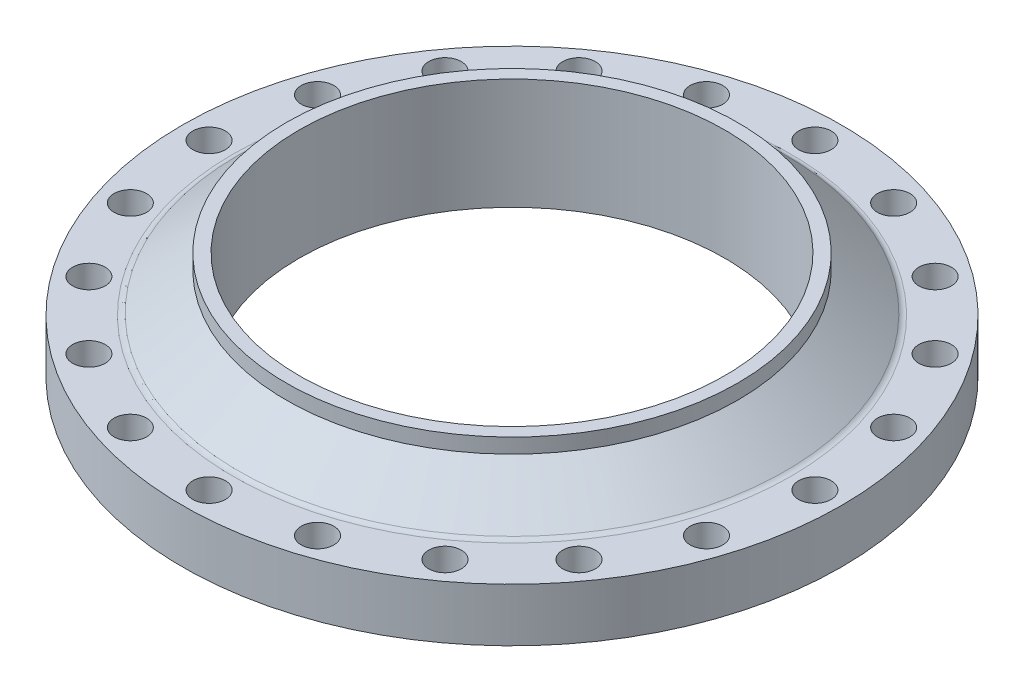
ISO-10303-21;
HEADER;
FILE_DESCRIPTION(('STEP AP214'),'2;1');
FILE_NAME('part.step','',(''),(''),'','','');
FILE_SCHEMA(('AUTOMOTIVE_DESIGN { 1 0 10303 214 1 1 1 1 }'));
ENDSEC;
DATA;
#1=APPLICATION_CONTEXT('core data for automotive mechanical design processes');
#2=APPLICATION_PROTOCOL_DEFINITION('international standard','automotive_design',2000,#1);
#3=PRODUCT_CONTEXT('',#1,'mechanical');
#4=PRODUCT('Part','Part','',(#3));
#5=PRODUCT_RELATED_PRODUCT_CATEGORY('part','',(#4));
#6=PRODUCT_DEFINITION_FORMATION('','',#4);
#7=PRODUCT_DEFINITION_CONTEXT('part definition',#1,'design');
#8=PRODUCT_DEFINITION('design','',#6,#7);
#9=PRODUCT_DEFINITION_SHAPE('','',#8);
#10=(LENGTH_UNIT() NAMED_UNIT(*) SI_UNIT(.MILLI.,.METRE.));
#11=(NAMED_UNIT(*) PLANE_ANGLE_UNIT() SI_UNIT($,.RADIAN.));
#12=(NAMED_UNIT(*) SI_UNIT($,.STERADIAN.) SOLID_ANGLE_UNIT());
#13=UNCERTAINTY_MEASURE_WITH_UNIT(LENGTH_MEASURE(1.E-05),#10,'distance_accuracy_value','');
#14=(GEOMETRIC_REPRESENTATION_CONTEXT(3) GLOBAL_UNCERTAINTY_ASSIGNED_CONTEXT((#13)) GLOBAL_UNIT_ASSIGNED_CONTEXT((#10,
#11,#12)) REPRESENTATION_CONTEXT('',''));
#15=CARTESIAN_POINT('',(0.,0.,0.));
#16=DIRECTION('',(0.,0.,1.));
#17=DIRECTION('',(1.,0.,0.));
#18=AXIS2_PLACEMENT_3D('',#15,#16,#17);
#19=CARTESIAN_POINT('',(0.,150.,0.));
#20=DIRECTION('',(0.,1.,0.));
#21=DIRECTION('',(-1.,0.,0.));
#22=AXIS2_PLACEMENT_3D('',#19,#20,#21);
#23=CYLINDRICAL_SURFACE('',#22,287.4);
#24=CARTESIAN_POINT('',(0.,0.,0.));
#25=DIRECTION('',(0.,1.,0.));
#26=DIRECTION('',(-1.,0.,0.));
#27=AXIS2_PLACEMENT_3D('',#24,#25,#26);
#28=CIRCLE('',#27,287.4);
#29=CARTESIAN_POINT('',(-287.4,0.,0.));
#30=VERTEX_POINT('',#29);
#31=EDGE_CURVE('E10',#30,#30,#28,.T.);
#32=ORIENTED_EDGE('',*,*,#31,.F.);
#33=EDGE_LOOP('',(#32));
#34=FACE_BOUND('',#33,.T.);
#35=CARTESIAN_POINT('',(0.,150.,0.));
#36=DIRECTION('',(0.,1.,0.));
#37=DIRECTION('',(-1.,0.,0.));
#38=AXIS2_PLACEMENT_3D('',#35,#36,#37);
#39=CIRCLE('',#38,287.4);
#40=CARTESIAN_POINT('',(-287.4,150.,0.));
#41=VERTEX_POINT('',#40);
#42=EDGE_CURVE('E80',#41,#41,#39,.T.);
#43=ORIENTED_EDGE('',*,*,#42,.T.);
#44=EDGE_LOOP('',(#43));
#45=FACE_BOUND('',#44,.T.);
#46=ADVANCED_FACE('F37',(#34,#45),#23,.F.);
#47=CARTESIAN_POINT('',(370.,0.,0.));
#48=DIRECTION('',(0.,1.,0.));
#49=DIRECTION('',(-1.,0.,0.));
#50=AXIS2_PLACEMENT_3D('',#47,#48,#49);
#51=PLANE('',#50);
#52=CARTESIAN_POINT('',(0.,0.,0.));
#53=DIRECTION('',(0.,1.,0.));
#54=DIRECTION('',(-1.,0.,0.));
#55=AXIS2_PLACEMENT_3D('',#52,#53,#54);
#56=CIRCLE('',#55,370.);
#57=CARTESIAN_POINT('',(-370.,0.,0.));
#58=VERTEX_POINT('',#57);
#59=EDGE_CURVE('E44',#58,#58,#56,.T.);
#60=ORIENTED_EDGE('',*,*,#59,.F.);
#61=EDGE_LOOP('',(#60));
#62=FACE_BOUND('',#61,.T.);
#63=ORIENTED_EDGE('',*,*,#31,.T.);
#64=EDGE_LOOP('',(#63));
#65=FACE_BOUND('',#64,.T.);
#66=ADVANCED_FACE('F266',(#62,#65),#51,.F.);
#67=CARTESIAN_POINT('',(0.,0.,0.));
#68=DIRECTION('',(0.,1.,0.));
#69=DIRECTION('',(-1.,0.,0.));
#70=AXIS2_PLACEMENT_3D('',#67,#68,#69);
#71=CONICAL_SURFACE('',#70,370.,0.785398163397448);
#72=CARTESIAN_POINT('',(0.,5.,0.));
#73=DIRECTION('',(0.,1.,0.));
#74=DIRECTION('',(-1.,0.,0.));
#75=AXIS2_PLACEMENT_3D('',#72,#73,#74);
#76=CIRCLE('',#75,375.);
#77=CARTESIAN_POINT('',(-375.,5.00000000000001,0.));
#78=VERTEX_POINT('',#77);
#79=EDGE_CURVE('E49',#78,#78,#76,.T.);
#80=ORIENTED_EDGE('',*,*,#79,.F.);
#81=EDGE_LOOP('',(#80));
#82=FACE_BOUND('',#81,.T.);
#83=ORIENTED_EDGE('',*,*,#59,.T.);
#84=EDGE_LOOP('',(#83));
#85=FACE_BOUND('',#84,.T.);
#86=ADVANCED_FACE('F252',(#82,#85),#71,.T.);
#87=CARTESIAN_POINT('',(445.,5.00000000000001,0.));
#88=DIRECTION('',(0.,1.,0.));
#89=DIRECTION('',(-1.,0.,0.));
#90=AXIS2_PLACEMENT_3D('',#87,#88,#89);
#91=PLANE('',#90);
#92=CARTESIAN_POINT('',(-388.98211516471,5.00000000000002,126.387950699342));
#93=DIRECTION('',(0.,-1.,0.));
#94=DIRECTION('',(1.,0.,0.));
#95=AXIS2_PLACEMENT_3D('',#92,#93,#94);
#96=CIRCLE('',#95,22.0000000000154);
#97=CARTESIAN_POINT('',(-366.982115164694,5.00000000000002,126.387950699342));
#98=VERTEX_POINT('',#97);
#99=EDGE_CURVE('E162',#98,#98,#96,.T.);
#100=ORIENTED_EDGE('',*,*,#99,.F.);
#101=EDGE_LOOP('',(#100));
#102=FACE_BOUND('',#101,.T.);
#103=CARTESIAN_POINT('',(-408.999999999988,5.00000000000003,-1.16244791570352E-11));
#104=DIRECTION('',(0.,-1.,0.));
#105=DIRECTION('',(1.,0.,0.));
#106=AXIS2_PLACEMENT_3D('',#103,#104,#105);
#107=CIRCLE('',#106,22.0000000000186);
#108=CARTESIAN_POINT('',(-386.99999999997,5.00000000000002,-1.16244791570352E-11));
#109=VERTEX_POINT('',#108);
#110=EDGE_CURVE('E161',#109,#109,#107,.T.);
#111=ORIENTED_EDGE('',*,*,#110,.F.);
#112=EDGE_LOOP('',(#111));
#113=FACE_BOUND('',#112,.T.);
#114=CARTESIAN_POINT('',(-388.982115164703,5.00000000000002,-126.387950699365));
#115=DIRECTION('',(0.,-1.,0.));
#116=DIRECTION('',(1.,0.,0.));
#117=AXIS2_PLACEMENT_3D('',#114,#115,#116);
#118=CIRCLE('',#117,22.0000000000215);
#119=CARTESIAN_POINT('',(-366.982115164681,5.00000000000002,-126.387950699365));
#120=VERTEX_POINT('',#119);
#121=EDGE_CURVE('E171',#120,#120,#118,.T.);
#122=ORIENTED_EDGE('',*,*,#121,.F.);
#123=EDGE_LOOP('',(#122));
#124=FACE_BOUND('',#123,.T.);
#125=CARTESIAN_POINT('',(-330.887950699335,5.00000000000002,-240.404168187631));
#126=DIRECTION('',(0.,-1.,0.));
#127=DIRECTION('',(1.,0.,0.));
#128=AXIS2_PLACEMENT_3D('',#125,#126,#127);
#129=CIRCLE('',#128,22.0000000000241);
#130=CARTESIAN_POINT('',(-308.887950699311,5.00000000000002,-240.404168187631));
#131=VERTEX_POINT('',#130);
#132=EDGE_CURVE('E179',#131,#131,#129,.T.);
#133=ORIENTED_EDGE('',*,*,#132,.F.);
#134=EDGE_LOOP('',(#133));
#135=FACE_BOUND('',#134,.T.);
#136=CARTESIAN_POINT('',(-240.404168187601,5.00000000000002,-330.88795069936));
#137=DIRECTION('',(0.,-1.,0.));
#138=DIRECTION('',(1.,0.,0.));
#139=AXIS2_PLACEMENT_3D('',#136,#137,#138);
#140=CIRCLE('',#139,22.0000000000254);
#141=CARTESIAN_POINT('',(-218.404168187575,5.00000000000002,-330.88795069936));
#142=VERTEX_POINT('',#141);
#143=EDGE_CURVE('E187',#142,#142,#140,.T.);
#144=ORIENTED_EDGE('',*,*,#143,.F.);
#145=EDGE_LOOP('',(#144));
#146=FACE_BOUND('',#145,.T.);
#147=CARTESIAN_POINT('',(-126.387950699331,5.00000000000002,-388.982115164721));
#148=DIRECTION('',(0.,-1.,0.));
#149=DIRECTION('',(1.,0.,0.));
#150=AXIS2_PLACEMENT_3D('',#147,#148,#149);
#151=CIRCLE('',#150,22.0000000000257);
#152=CARTESIAN_POINT('',(-104.387950699305,5.00000000000002,-388.982115164721));
#153=VERTEX_POINT('',#152);
#154=EDGE_CURVE('E195',#153,#153,#151,.T.);
#155=ORIENTED_EDGE('',*,*,#154,.F.);
#156=EDGE_LOOP('',(#155));
#157=FACE_BOUND('',#156,.T.);
#158=CARTESIAN_POINT('',(2.31488939371632E-11,5.00000000000002,-409.));
#159=DIRECTION('',(0.,-1.,0.));
#160=DIRECTION('',(1.,0.,0.));
#161=AXIS2_PLACEMENT_3D('',#158,#159,#160);
#162=CIRCLE('',#161,22.0000000000249);
#163=CARTESIAN_POINT('',(22.000000000048,5.00000000000002,-409.));
#164=VERTEX_POINT('',#163);
#165=EDGE_CURVE('E203',#164,#164,#162,.T.);
#166=ORIENTED_EDGE('',*,*,#165,.F.);
#167=EDGE_LOOP('',(#166));
#168=FACE_BOUND('',#167,.T.);
#169=CARTESIAN_POINT('',(126.387950699376,5.00000000000001,-388.982115164714));
#170=DIRECTION('',(0.,-1.,0.));
#171=DIRECTION('',(1.,0.,0.));
#172=AXIS2_PLACEMENT_3D('',#169,#170,#171);
#173=CIRCLE('',#172,22.0000000000231);
#174=CARTESIAN_POINT('',(148.387950699399,5.00000000000001,-388.982115164714));
#175=VERTEX_POINT('',#174);
#176=EDGE_CURVE('E211',#175,#175,#173,.T.);
#177=ORIENTED_EDGE('',*,*,#176,.F.);
#178=EDGE_LOOP('',(#177));
#179=FACE_BOUND('',#178,.T.);
#180=CARTESIAN_POINT('',(240.404168187642,5.00000000000001,-330.887950699347));
#181=DIRECTION('',(0.,-1.,0.));
#182=DIRECTION('',(1.,0.,0.));
#183=AXIS2_PLACEMENT_3D('',#180,#181,#182);
#184=CIRCLE('',#183,22.0000000000203);
#185=CARTESIAN_POINT('',(262.404168187663,5.00000000000001,-330.887950699347));
#186=VERTEX_POINT('',#185);
#187=EDGE_CURVE('E98',#186,#186,#184,.T.);
#188=ORIENTED_EDGE('',*,*,#187,.F.);
#189=EDGE_LOOP('',(#188));
#190=FACE_BOUND('',#189,.T.);
#191=CARTESIAN_POINT('',(330.887950699372,5.00000000000001,-240.404168187612));
#192=DIRECTION('',(0.,-1.,0.));
#193=DIRECTION('',(1.,0.,0.));
#194=AXIS2_PLACEMENT_3D('',#191,#192,#193);
#195=CIRCLE('',#194,22.0000000000167);
#196=CARTESIAN_POINT('',(352.887950699389,5.00000000000001,-240.404168187612));
#197=VERTEX_POINT('',#196);
#198=EDGE_CURVE('E97',#197,#197,#195,.T.);
#199=ORIENTED_EDGE('',*,*,#198,.F.);
#200=EDGE_LOOP('',(#199));
#201=FACE_BOUND('',#200,.T.);
#202=CARTESIAN_POINT('',(388.982115164733,5.00000000000001,-126.387950699342));
#203=DIRECTION('',(0.,-1.,0.));
#204=DIRECTION('',(1.,0.,0.));
#205=AXIS2_PLACEMENT_3D('',#202,#203,#204);
#206=CIRCLE('',#205,22.000000000013);
#207=CARTESIAN_POINT('',(410.982115164746,5.00000000000001,-126.387950699342));
#208=VERTEX_POINT('',#207);
#209=EDGE_CURVE('E107',#208,#208,#206,.T.);
#210=ORIENTED_EDGE('',*,*,#209,.F.);
#211=EDGE_LOOP('',(#210));
#212=FACE_BOUND('',#211,.T.);
#213=CARTESIAN_POINT('',(409.000000000012,5.00000000000001,1.15743911029501E-11));
#214=DIRECTION('',(0.,-1.,0.));
#215=DIRECTION('',(1.,0.,0.));
#216=AXIS2_PLACEMENT_3D('',#213,#214,#215);
#217=CIRCLE('',#216,22.0000000000091);
#218=CARTESIAN_POINT('',(431.000000000021,5.00000000000001,1.15743911029501E-11));
#219=VERTEX_POINT('',#218);
#220=EDGE_CURVE('E115',#219,#219,#217,.T.);
#221=ORIENTED_EDGE('',*,*,#220,.F.);
#222=EDGE_LOOP('',(#221));
#223=FACE_BOUND('',#222,.T.);
#224=CARTESIAN_POINT('',(388.982115164726,5.00000000000001,126.387950699365));
#225=DIRECTION('',(0.,-1.,0.));
#226=DIRECTION('',(1.,0.,0.));
#227=AXIS2_PLACEMENT_3D('',#224,#225,#226);
#228=CIRCLE('',#227,22.0000000000057);
#229=CARTESIAN_POINT('',(410.982115164732,5.00000000000001,126.387950699365));
#230=VERTEX_POINT('',#229);
#231=EDGE_CURVE('E123',#230,#230,#228,.T.);
#232=ORIENTED_EDGE('',*,*,#231,.F.);
#233=EDGE_LOOP('',(#232));
#234=FACE_BOUND('',#233,.T.);
#235=CARTESIAN_POINT('',(330.887950699358,5.00000000000001,240.404168187631));
#236=DIRECTION('',(0.,-1.,0.));
#237=DIRECTION('',(1.,0.,0.));
#238=AXIS2_PLACEMENT_3D('',#235,#236,#237);
#239=CIRCLE('',#238,22.0000000000027);
#240=CARTESIAN_POINT('',(352.887950699361,5.00000000000001,240.404168187631));
#241=VERTEX_POINT('',#240);
#242=EDGE_CURVE('E131',#241,#241,#239,.T.);
#243=ORIENTED_EDGE('',*,*,#242,.F.);
#244=EDGE_LOOP('',(#243));
#245=FACE_BOUND('',#244,.T.);
#246=CARTESIAN_POINT('',(240.404168187622,5.00000000000001,330.887950699353));
#247=DIRECTION('',(0.,-1.,0.));
#248=DIRECTION('',(1.,0.,0.));
#249=AXIS2_PLACEMENT_3D('',#246,#247,#248);
#250=CIRCLE('',#249,22.);
#251=CARTESIAN_POINT('',(262.404168187622,5.00000000000001,330.887950699353));
#252=VERTEX_POINT('',#251);
#253=EDGE_CURVE('E139',#252,#252,#250,.T.);
#254=ORIENTED_EDGE('',*,*,#253,.F.);
#255=EDGE_LOOP('',(#254));
#256=FACE_BOUND('',#255,.T.);
#257=CARTESIAN_POINT('',(126.387950699354,5.00000000000001,388.982115164718));
#258=DIRECTION('',(0.,-1.,0.));
#259=DIRECTION('',(1.,0.,0.));
#260=AXIS2_PLACEMENT_3D('',#257,#258,#259);
#261=CIRCLE('',#260,22.);
#262=CARTESIAN_POINT('',(148.387950699354,5.00000000000001,388.982115164718));
#263=VERTEX_POINT('',#262);
#264=EDGE_CURVE('E147',#263,#263,#261,.T.);
#265=ORIENTED_EDGE('',*,*,#264,.F.);
#266=EDGE_LOOP('',(#265));
#267=FACE_BOUND('',#266,.T.);
#268=CARTESIAN_POINT('',(-330.887950699349,5.00000000000002,240.404168187612));
#269=DIRECTION('',(0.,-1.,0.));
#270=DIRECTION('',(1.,0.,0.));
#271=AXIS2_PLACEMENT_3D('',#268,#269,#270);
#272=CIRCLE('',#271,22.0000000000122);
#273=CARTESIAN_POINT('',(-308.887950699336,5.00000000000002,240.404168187612));
#274=VERTEX_POINT('',#273);
#275=EDGE_CURVE('E234',#274,#274,#272,.T.);
#276=ORIENTED_EDGE('',*,*,#275,.F.);
#277=EDGE_LOOP('',(#276));
#278=FACE_BOUND('',#277,.T.);
#279=CARTESIAN_POINT('',(-240.404168187619,5.00000000000002,330.887950699347));
#280=DIRECTION('',(0.,-1.,0.));
#281=DIRECTION('',(1.,0.,0.));
#282=AXIS2_PLACEMENT_3D('',#279,#280,#281);
#283=CIRCLE('',#282,22.0000000000093);
#284=CARTESIAN_POINT('',(-218.40416818761,5.00000000000002,330.887950699347));
#285=VERTEX_POINT('',#284);
#286=EDGE_CURVE('E225',#285,#285,#283,.T.);
#287=ORIENTED_EDGE('',*,*,#286,.F.);
#288=EDGE_LOOP('',(#287));
#289=FACE_BOUND('',#288,.T.);
#290=CARTESIAN_POINT('',(-126.387950699348,5.00000000000002,388.982115164719));
#291=DIRECTION('',(0.,-1.,0.));
#292=DIRECTION('',(1.,0.,0.));
#293=AXIS2_PLACEMENT_3D('',#290,#291,#292);
#294=CIRCLE('',#293,22.);
#295=CARTESIAN_POINT('',(-104.387950699348,5.00000000000002,388.982115164719));
#296=VERTEX_POINT('',#295);
#297=EDGE_CURVE('E226',#296,#296,#294,.T.);
#298=ORIENTED_EDGE('',*,*,#297,.F.);
#299=EDGE_LOOP('',(#298));
#300=FACE_BOUND('',#299,.T.);
#301=CARTESIAN_POINT('',(0.,5.00000000000002,409.));
#302=DIRECTION('',(0.,-1.,0.));
#303=DIRECTION('',(1.,0.,0.));
#304=AXIS2_PLACEMENT_3D('',#301,#302,#303);
#305=CIRCLE('',#304,22.);
#306=CARTESIAN_POINT('',(22.,5.00000000000002,409.));
#307=VERTEX_POINT('',#306);
#308=EDGE_CURVE('E88',#307,#307,#305,.T.);
#309=ORIENTED_EDGE('',*,*,#308,.F.);
#310=EDGE_LOOP('',(#309));
#311=FACE_BOUND('',#310,.T.);
#312=CARTESIAN_POINT('',(0.,5.,0.));
#313=DIRECTION('',(0.,1.,0.));
#314=DIRECTION('',(-1.,0.,0.));
#315=AXIS2_PLACEMENT_3D('',#312,#313,#314);
#316=CIRCLE('',#315,445.);
#317=CARTESIAN_POINT('',(-445.,5.00000000000001,0.));
#318=VERTEX_POINT('',#317);
#319=EDGE_CURVE('E54',#318,#318,#316,.T.);
#320=ORIENTED_EDGE('',*,*,#319,.F.);
#321=EDGE_LOOP('',(#320));
#322=FACE_BOUND('',#321,.T.);
#323=ORIENTED_EDGE('',*,*,#79,.T.);
#324=EDGE_LOOP('',(#323));
#325=FACE_BOUND('',#324,.T.);
#326=ADVANCED_FACE('F248',(#102,#113,#124,#135,#146,#157,#168,#179,#190,#201,#212,#223,#234,
#245,#256,#267,#278,#289,#300,#311,#322,#325),#91,.F.);
#327=CARTESIAN_POINT('',(0.,150.,0.));
#328=DIRECTION('',(0.,1.,0.));
#329=DIRECTION('',(-1.,0.,0.));
#330=AXIS2_PLACEMENT_3D('',#327,#328,#329);
#331=CYLINDRICAL_SURFACE('',#330,445.);
#332=CARTESIAN_POINT('',(0.,77.,0.));
#333=DIRECTION('',(0.,1.,0.));
#334=DIRECTION('',(-1.,0.,0.));
#335=AXIS2_PLACEMENT_3D('',#332,#333,#334);
#336=CIRCLE('',#335,445.);
#337=CARTESIAN_POINT('',(-445.,77.,0.));
#338=VERTEX_POINT('',#337);
#339=EDGE_CURVE('E60',#338,#338,#336,.T.);
#340=ORIENTED_EDGE('',*,*,#339,.F.);
#341=EDGE_LOOP('',(#340));
#342=FACE_BOUND('',#341,.T.);
#343=ORIENTED_EDGE('',*,*,#319,.T.);
#344=EDGE_LOOP('',(#343));
#345=FACE_BOUND('',#344,.T.);
#346=ADVANCED_FACE('F251',(#342,#345),#331,.T.);
#347=CARTESIAN_POINT('',(376.76883786571,77.,0.));
#348=DIRECTION('',(0.,-1.,0.));
#349=DIRECTION('',(1.,0.,0.));
#350=AXIS2_PLACEMENT_3D('',#347,#348,#349);
#351=PLANE('',#350);
#352=CARTESIAN_POINT('',(-388.98211516471,77.,126.387950699342));
#353=DIRECTION('',(0.,-1.,0.));
#354=DIRECTION('',(1.,0.,0.));
#355=AXIS2_PLACEMENT_3D('',#352,#353,#354);
#356=CIRCLE('',#355,22.0000000000154);
#357=CARTESIAN_POINT('',(-366.982115164694,77.,126.387950699342));
#358=VERTEX_POINT('',#357);
#359=EDGE_CURVE('E157',#358,#358,#356,.F.);
#360=ORIENTED_EDGE('',*,*,#359,.F.);
#361=EDGE_LOOP('',(#360));
#362=FACE_BOUND('',#361,.T.);
#363=CARTESIAN_POINT('',(-408.999999999988,77.,-1.16244791570352E-11));
#364=DIRECTION('',(0.,-1.,0.));
#365=DIRECTION('',(1.,0.,0.));
#366=AXIS2_PLACEMENT_3D('',#363,#364,#365);
#367=CIRCLE('',#366,22.0000000000186);
#368=CARTESIAN_POINT('',(-386.99999999997,77.,-1.16244791570352E-11));
#369=VERTEX_POINT('',#368);
#370=EDGE_CURVE('E167',#369,#369,#367,.F.);
#371=ORIENTED_EDGE('',*,*,#370,.F.);
#372=EDGE_LOOP('',(#371));
#373=FACE_BOUND('',#372,.T.);
#374=CARTESIAN_POINT('',(-388.982115164703,77.,-126.387950699365));
#375=DIRECTION('',(0.,-1.,0.));
#376=DIRECTION('',(1.,0.,0.));
#377=AXIS2_PLACEMENT_3D('',#374,#375,#376);
#378=CIRCLE('',#377,22.0000000000215);
#379=CARTESIAN_POINT('',(-366.982115164681,77.,-126.387950699365));
#380=VERTEX_POINT('',#379);
#381=EDGE_CURVE('E175',#380,#380,#378,.F.);
#382=ORIENTED_EDGE('',*,*,#381,.F.);
#383=EDGE_LOOP('',(#382));
#384=FACE_BOUND('',#383,.T.);
#385=CARTESIAN_POINT('',(-330.887950699335,77.,-240.404168187631));
#386=DIRECTION('',(0.,-1.,0.));
#387=DIRECTION('',(1.,0.,0.));
#388=AXIS2_PLACEMENT_3D('',#385,#386,#387);
#389=CIRCLE('',#388,22.0000000000241);
#390=CARTESIAN_POINT('',(-308.887950699311,77.,-240.404168187631));
#391=VERTEX_POINT('',#390);
#392=EDGE_CURVE('E183',#391,#391,#389,.F.);
#393=ORIENTED_EDGE('',*,*,#392,.F.);
#394=EDGE_LOOP('',(#393));
#395=FACE_BOUND('',#394,.T.);
#396=CARTESIAN_POINT('',(-240.404168187601,77.,-330.88795069936));
#397=DIRECTION('',(0.,-1.,0.));
#398=DIRECTION('',(1.,0.,0.));
#399=AXIS2_PLACEMENT_3D('',#396,#397,#398);
#400=CIRCLE('',#399,22.0000000000254);
#401=CARTESIAN_POINT('',(-218.404168187575,77.,-330.88795069936));
#402=VERTEX_POINT('',#401);
#403=EDGE_CURVE('E191',#402,#402,#400,.F.);
#404=ORIENTED_EDGE('',*,*,#403,.F.);
#405=EDGE_LOOP('',(#404));
#406=FACE_BOUND('',#405,.T.);
#407=CARTESIAN_POINT('',(-126.387950699331,77.,-388.982115164721));
#408=DIRECTION('',(0.,-1.,0.));
#409=DIRECTION('',(1.,0.,0.));
#410=AXIS2_PLACEMENT_3D('',#407,#408,#409);
#411=CIRCLE('',#410,22.0000000000257);
#412=CARTESIAN_POINT('',(-104.387950699305,77.,-388.982115164721));
#413=VERTEX_POINT('',#412);
#414=EDGE_CURVE('E199',#413,#413,#411,.F.);
#415=ORIENTED_EDGE('',*,*,#414,.F.);
#416=EDGE_LOOP('',(#415));
#417=FACE_BOUND('',#416,.T.);
#418=CARTESIAN_POINT('',(2.31505028673494E-11,77.,-409.));
#419=DIRECTION('',(0.,-1.,0.));
#420=DIRECTION('',(1.,0.,0.));
#421=AXIS2_PLACEMENT_3D('',#418,#419,#420);
#422=CIRCLE('',#421,22.0000000000249);
#423=CARTESIAN_POINT('',(22.000000000048,77.,-409.));
#424=VERTEX_POINT('',#423);
#425=EDGE_CURVE('E207',#424,#424,#422,.F.);
#426=ORIENTED_EDGE('',*,*,#425,.F.);
#427=EDGE_LOOP('',(#426));
#428=FACE_BOUND('',#427,.T.);
#429=CARTESIAN_POINT('',(126.387950699376,77.,-388.982115164714));
#430=DIRECTION('',(0.,-1.,0.));
#431=DIRECTION('',(1.,0.,0.));
#432=AXIS2_PLACEMENT_3D('',#429,#430,#431);
#433=CIRCLE('',#432,22.0000000000231);
#434=CARTESIAN_POINT('',(148.387950699399,77.,-388.982115164714));
#435=VERTEX_POINT('',#434);
#436=EDGE_CURVE('E102',#435,#435,#433,.F.);
#437=ORIENTED_EDGE('',*,*,#436,.F.);
#438=EDGE_LOOP('',(#437));
#439=FACE_BOUND('',#438,.T.);
#440=CARTESIAN_POINT('',(240.404168187642,77.,-330.887950699347));
#441=DIRECTION('',(0.,-1.,0.));
#442=DIRECTION('',(1.,0.,0.));
#443=AXIS2_PLACEMENT_3D('',#440,#441,#442);
#444=CIRCLE('',#443,22.0000000000203);
#445=CARTESIAN_POINT('',(262.404168187663,77.,-330.887950699347));
#446=VERTEX_POINT('',#445);
#447=EDGE_CURVE('E93',#446,#446,#444,.F.);
#448=ORIENTED_EDGE('',*,*,#447,.F.);
#449=EDGE_LOOP('',(#448));
#450=FACE_BOUND('',#449,.T.);
#451=CARTESIAN_POINT('',(330.887950699372,77.,-240.404168187612));
#452=DIRECTION('',(0.,-1.,0.));
#453=DIRECTION('',(1.,0.,0.));
#454=AXIS2_PLACEMENT_3D('',#451,#452,#453);
#455=CIRCLE('',#454,22.0000000000167);
#456=CARTESIAN_POINT('',(352.887950699389,77.,-240.404168187612));
#457=VERTEX_POINT('',#456);
#458=EDGE_CURVE('E103',#457,#457,#455,.F.);
#459=ORIENTED_EDGE('',*,*,#458,.F.);
#460=EDGE_LOOP('',(#459));
#461=FACE_BOUND('',#460,.T.);
#462=CARTESIAN_POINT('',(388.982115164733,77.,-126.387950699342));
#463=DIRECTION('',(0.,-1.,0.));
#464=DIRECTION('',(1.,0.,0.));
#465=AXIS2_PLACEMENT_3D('',#462,#463,#464);
#466=CIRCLE('',#465,22.000000000013);
#467=CARTESIAN_POINT('',(410.982115164746,77.,-126.387950699342));
#468=VERTEX_POINT('',#467);
#469=EDGE_CURVE('E111',#468,#468,#466,.F.);
#470=ORIENTED_EDGE('',*,*,#469,.F.);
#471=EDGE_LOOP('',(#470));
#472=FACE_BOUND('',#471,.T.);
#473=CARTESIAN_POINT('',(409.000000000012,77.,1.15743911029501E-11));
#474=DIRECTION('',(0.,-1.,0.));
#475=DIRECTION('',(1.,0.,0.));
#476=AXIS2_PLACEMENT_3D('',#473,#474,#475);
#477=CIRCLE('',#476,22.0000000000091);
#478=CARTESIAN_POINT('',(431.000000000021,77.,1.15743911029501E-11));
#479=VERTEX_POINT('',#478);
#480=EDGE_CURVE('E119',#479,#479,#477,.F.);
#481=ORIENTED_EDGE('',*,*,#480,.F.);
#482=EDGE_LOOP('',(#481));
#483=FACE_BOUND('',#482,.T.);
#484=CARTESIAN_POINT('',(388.982115164726,77.,126.387950699365));
#485=DIRECTION('',(0.,-1.,0.));
#486=DIRECTION('',(1.,0.,0.));
#487=AXIS2_PLACEMENT_3D('',#484,#485,#486);
#488=CIRCLE('',#487,22.0000000000057);
#489=CARTESIAN_POINT('',(410.982115164732,77.,126.387950699365));
#490=VERTEX_POINT('',#489);
#491=EDGE_CURVE('E127',#490,#490,#488,.F.);
#492=ORIENTED_EDGE('',*,*,#491,.F.);
#493=EDGE_LOOP('',(#492));
#494=FACE_BOUND('',#493,.T.);
#495=CARTESIAN_POINT('',(330.887950699358,77.,240.404168187631));
#496=DIRECTION('',(0.,-1.,0.));
#497=DIRECTION('',(1.,0.,0.));
#498=AXIS2_PLACEMENT_3D('',#495,#496,#497);
#499=CIRCLE('',#498,22.0000000000027);
#500=CARTESIAN_POINT('',(352.887950699361,77.,240.404168187631));
#501=VERTEX_POINT('',#500);
#502=EDGE_CURVE('E135',#501,#501,#499,.F.);
#503=ORIENTED_EDGE('',*,*,#502,.F.);
#504=EDGE_LOOP('',(#503));
#505=FACE_BOUND('',#504,.T.);
#506=CARTESIAN_POINT('',(240.404168187622,77.,330.887950699353));
#507=DIRECTION('',(0.,-1.,0.));
#508=DIRECTION('',(1.,0.,0.));
#509=AXIS2_PLACEMENT_3D('',#506,#507,#508);
#510=CIRCLE('',#509,22.);
#511=CARTESIAN_POINT('',(262.404168187622,77.,330.887950699353));
#512=VERTEX_POINT('',#511);
#513=EDGE_CURVE('E143',#512,#512,#510,.F.);
#514=ORIENTED_EDGE('',*,*,#513,.F.);
#515=EDGE_LOOP('',(#514));
#516=FACE_BOUND('',#515,.T.);
#517=CARTESIAN_POINT('',(126.387950699354,77.,388.982115164718));
#518=DIRECTION('',(0.,-1.,0.));
#519=DIRECTION('',(1.,0.,0.));
#520=AXIS2_PLACEMENT_3D('',#517,#518,#519);
#521=CIRCLE('',#520,22.);
#522=CARTESIAN_POINT('',(148.387950699354,77.,388.982115164718));
#523=VERTEX_POINT('',#522);
#524=EDGE_CURVE('E92',#523,#523,#521,.F.);
#525=ORIENTED_EDGE('',*,*,#524,.F.);
#526=EDGE_LOOP('',(#525));
#527=FACE_BOUND('',#526,.T.);
#528=CARTESIAN_POINT('',(-330.887950699349,77.,240.404168187612));
#529=DIRECTION('',(0.,-1.,0.));
#530=DIRECTION('',(1.,0.,0.));
#531=AXIS2_PLACEMENT_3D('',#528,#529,#530);
#532=CIRCLE('',#531,22.0000000000122);
#533=CARTESIAN_POINT('',(-308.887950699336,77.,240.404168187612));
#534=VERTEX_POINT('',#533);
#535=EDGE_CURVE('E166',#534,#534,#532,.F.);
#536=ORIENTED_EDGE('',*,*,#535,.F.);
#537=EDGE_LOOP('',(#536));
#538=FACE_BOUND('',#537,.T.);
#539=CARTESIAN_POINT('',(-240.404168187619,77.,330.887950699347));
#540=DIRECTION('',(0.,-1.,0.));
#541=DIRECTION('',(1.,0.,0.));
#542=AXIS2_PLACEMENT_3D('',#539,#540,#541);
#543=CIRCLE('',#542,22.0000000000093);
#544=CARTESIAN_POINT('',(-218.40416818761,77.,330.887950699347));
#545=VERTEX_POINT('',#544);
#546=EDGE_CURVE('E230',#545,#545,#543,.F.);
#547=ORIENTED_EDGE('',*,*,#546,.F.);
#548=EDGE_LOOP('',(#547));
#549=FACE_BOUND('',#548,.T.);
#550=CARTESIAN_POINT('',(-126.387950699348,77.,388.982115164719));
#551=DIRECTION('',(0.,-1.,0.));
#552=DIRECTION('',(1.,0.,0.));
#553=AXIS2_PLACEMENT_3D('',#550,#551,#552);
#554=CIRCLE('',#553,22.);
#555=CARTESIAN_POINT('',(-104.387950699348,77.,388.982115164719));
#556=VERTEX_POINT('',#555);
#557=EDGE_CURVE('E221',#556,#556,#554,.F.);
#558=ORIENTED_EDGE('',*,*,#557,.F.);
#559=EDGE_LOOP('',(#558));
#560=FACE_BOUND('',#559,.T.);
#561=CARTESIAN_POINT('',(0.,77.,409.));
#562=DIRECTION('',(0.,-1.,0.));
#563=DIRECTION('',(1.,0.,0.));
#564=AXIS2_PLACEMENT_3D('',#561,#562,#563);
#565=CIRCLE('',#564,22.);
#566=CARTESIAN_POINT('',(22.,77.,409.));
#567=VERTEX_POINT('',#566);
#568=EDGE_CURVE('E84',#567,#567,#565,.F.);
#569=ORIENTED_EDGE('',*,*,#568,.F.);
#570=EDGE_LOOP('',(#569));
#571=FACE_BOUND('',#570,.T.);
#572=CARTESIAN_POINT('',(0.,77.,0.));
#573=DIRECTION('',(0.,1.,0.));
#574=DIRECTION('',(-1.,0.,0.));
#575=AXIS2_PLACEMENT_3D('',#572,#573,#574);
#576=CIRCLE('',#575,376.76883786571);
#577=CARTESIAN_POINT('',(-376.76883786571,77.,0.));
#578=VERTEX_POINT('',#577);
#579=EDGE_CURVE('E64',#578,#578,#576,.T.);
#580=ORIENTED_EDGE('',*,*,#579,.F.);
#581=EDGE_LOOP('',(#580));
#582=FACE_BOUND('',#581,.T.);
#583=ORIENTED_EDGE('',*,*,#339,.T.);
#584=EDGE_LOOP('',(#583));
#585=FACE_BOUND('',#584,.T.);
#586=ADVANCED_FACE('F301',(#362,#373,#384,#395,#406,#417,#428,#439,#450,#461,#472,#483,#494,
#505,#516,#527,#538,#549,#560,#571,#582,#585),#351,.F.);
#587=CARTESIAN_POINT('',(0.,89.,0.));
#588=DIRECTION('',(0.,1.,0.));
#589=DIRECTION('',(-1.,0.,0.));
#590=AXIS2_PLACEMENT_3D('',#587,#588,#589);
#591=TOROIDAL_SURFACE('',#590,376.768837865709,12.);
#592=CARTESIAN_POINT('',(0.,79.5438709567194,0.));
#593=DIRECTION('',(0.,1.,0.));
#594=DIRECTION('',(-1.,0.,0.));
#595=AXIS2_PLACEMENT_3D('',#592,#593,#594);
#596=CIRCLE('',#595,369.380900161802);
#597=CARTESIAN_POINT('',(-369.380900161802,79.5438709567194,0.));
#598=VERTEX_POINT('',#597);
#599=EDGE_CURVE('E68',#598,#598,#596,.T.);
#600=ORIENTED_EDGE('',*,*,#599,.F.);
#601=EDGE_LOOP('',(#600));
#602=FACE_BOUND('',#601,.T.);
#603=ORIENTED_EDGE('',*,*,#579,.T.);
#604=EDGE_LOOP('',(#603));
#605=FACE_BOUND('',#604,.T.);
#606=ADVANCED_FACE('F295',(#602,#605),#591,.F.);
#607=CARTESIAN_POINT('',(0.,79.5438709567194,0.));
#608=DIRECTION('',(0.,-1.,0.));
#609=DIRECTION('',(1.,0.,0.));
#610=AXIS2_PLACEMENT_3D('',#607,#608,#609);
#611=CONICAL_SURFACE('',#610,369.380900161802,0.907571211037054);
#612=CARTESIAN_POINT('',(0.,130.,0.));
#613=DIRECTION('',(0.,1.,0.));
#614=DIRECTION('',(-1.,0.,0.));
#615=AXIS2_PLACEMENT_3D('',#612,#613,#614);
#616=CIRCLE('',#615,304.8);
#617=CARTESIAN_POINT('',(-304.8,130.,0.));
#618=VERTEX_POINT('',#617);
#619=EDGE_CURVE('E72',#618,#618,#616,.T.);
#620=ORIENTED_EDGE('',*,*,#619,.F.);
#621=EDGE_LOOP('',(#620));
#622=FACE_BOUND('',#621,.T.);
#623=ORIENTED_EDGE('',*,*,#599,.T.);
#624=EDGE_LOOP('',(#623));
#625=FACE_BOUND('',#624,.T.);
#626=ADVANCED_FACE('F289',(#622,#625),#611,.T.);
#627=CARTESIAN_POINT('',(0.,150.,0.));
#628=DIRECTION('',(0.,1.,0.));
#629=DIRECTION('',(-1.,0.,0.));
#630=AXIS2_PLACEMENT_3D('',#627,#628,#629);
#631=CYLINDRICAL_SURFACE('',#630,304.8);
#632=CARTESIAN_POINT('',(0.,150.,0.));
#633=DIRECTION('',(0.,1.,0.));
#634=DIRECTION('',(-1.,0.,0.));
#635=AXIS2_PLACEMENT_3D('',#632,#633,#634);
#636=CIRCLE('',#635,304.8);
#637=CARTESIAN_POINT('',(-304.8,150.,0.));
#638=VERTEX_POINT('',#637);
#639=EDGE_CURVE('E76',#638,#638,#636,.T.);
#640=ORIENTED_EDGE('',*,*,#639,.F.);
#641=EDGE_LOOP('',(#640));
#642=FACE_BOUND('',#641,.T.);
#643=ORIENTED_EDGE('',*,*,#619,.T.);
#644=EDGE_LOOP('',(#643));
#645=FACE_BOUND('',#644,.T.);
#646=ADVANCED_FACE('F283',(#642,#645),#631,.T.);
#647=CARTESIAN_POINT('',(287.4,150.,0.));
#648=DIRECTION('',(0.,-1.,0.));
#649=DIRECTION('',(1.,0.,0.));
#650=AXIS2_PLACEMENT_3D('',#647,#648,#649);
#651=PLANE('',#650);
#652=ORIENTED_EDGE('',*,*,#42,.F.);
#653=EDGE_LOOP('',(#652));
#654=FACE_BOUND('',#653,.T.);
#655=ORIENTED_EDGE('',*,*,#639,.T.);
#656=EDGE_LOOP('',(#655));
#657=FACE_BOUND('',#656,.T.);
#658=ADVANCED_FACE('F279',(#654,#657),#651,.F.);
#659=CARTESIAN_POINT('',(0.,150.001,409.));
#660=DIRECTION('',(0.,-1.,0.));
#661=DIRECTION('',(1.,0.,0.));
#662=AXIS2_PLACEMENT_3D('',#659,#660,#661);
#663=CYLINDRICAL_SURFACE('',#662,22.);
#664=ORIENTED_EDGE('',*,*,#308,.T.);
#665=EDGE_LOOP('',(#664));
#666=FACE_BOUND('',#665,.T.);
#667=ORIENTED_EDGE('',*,*,#568,.T.);
#668=EDGE_LOOP('',(#667));
#669=FACE_BOUND('',#668,.T.);
#670=ADVANCED_FACE('F282',(#666,#669),#663,.F.);
#671=CARTESIAN_POINT('',(-126.387950699348,150.001,388.982115164719));
#672=DIRECTION('',(0.,-1.,0.));
#673=DIRECTION('',(1.,0.,0.));
#674=AXIS2_PLACEMENT_3D('',#671,#672,#673);
#675=CYLINDRICAL_SURFACE('',#674,22.);
#676=ORIENTED_EDGE('',*,*,#297,.T.);
#677=EDGE_LOOP('',(#676));
#678=FACE_BOUND('',#677,.T.);
#679=ORIENTED_EDGE('',*,*,#557,.T.);
#680=EDGE_LOOP('',(#679));
#681=FACE_BOUND('',#680,.T.);
#682=ADVANCED_FACE('F319',(#678,#681),#675,.F.);
#683=CARTESIAN_POINT('',(-240.404168187619,150.001,330.887950699347));
#684=DIRECTION('',(0.,-1.,0.));
#685=DIRECTION('',(1.,0.,0.));
#686=AXIS2_PLACEMENT_3D('',#683,#684,#685);
#687=CYLINDRICAL_SURFACE('',#686,22.0000000000093);
#688=ORIENTED_EDGE('',*,*,#286,.T.);
#689=EDGE_LOOP('',(#688));
#690=FACE_BOUND('',#689,.T.);
#691=ORIENTED_EDGE('',*,*,#546,.T.);
#692=EDGE_LOOP('',(#691));
#693=FACE_BOUND('',#692,.T.);
#694=ADVANCED_FACE('F387',(#690,#693),#687,.F.);
#695=CARTESIAN_POINT('',(-330.887950699349,150.001,240.404168187612));
#696=DIRECTION('',(0.,-1.,0.));
#697=DIRECTION('',(1.,0.,0.));
#698=AXIS2_PLACEMENT_3D('',#695,#696,#697);
#699=CYLINDRICAL_SURFACE('',#698,22.0000000000122);
#700=ORIENTED_EDGE('',*,*,#275,.T.);
#701=EDGE_LOOP('',(#700));
#702=FACE_BOUND('',#701,.T.);
#703=ORIENTED_EDGE('',*,*,#535,.T.);
#704=EDGE_LOOP('',(#703));
#705=FACE_BOUND('',#704,.T.);
#706=ADVANCED_FACE('F245',(#702,#705),#699,.F.);
#707=CARTESIAN_POINT('',(126.387950699354,150.001,388.982115164718));
#708=DIRECTION('',(0.,-1.,0.));
#709=DIRECTION('',(1.,0.,0.));
#710=AXIS2_PLACEMENT_3D('',#707,#708,#709);
#711=CYLINDRICAL_SURFACE('',#710,22.);
#712=ORIENTED_EDGE('',*,*,#264,.T.);
#713=EDGE_LOOP('',(#712));
#714=FACE_BOUND('',#713,.T.);
#715=ORIENTED_EDGE('',*,*,#524,.T.);
#716=EDGE_LOOP('',(#715));
#717=FACE_BOUND('',#716,.T.);
#718=ADVANCED_FACE('F349',(#714,#717),#711,.F.);
#719=CARTESIAN_POINT('',(240.404168187622,150.001,330.887950699353));
#720=DIRECTION('',(0.,-1.,0.));
#721=DIRECTION('',(1.,0.,0.));
#722=AXIS2_PLACEMENT_3D('',#719,#720,#721);
#723=CYLINDRICAL_SURFACE('',#722,22.);
#724=ORIENTED_EDGE('',*,*,#253,.T.);
#725=EDGE_LOOP('',(#724));
#726=FACE_BOUND('',#725,.T.);
#727=ORIENTED_EDGE('',*,*,#513,.T.);
#728=EDGE_LOOP('',(#727));
#729=FACE_BOUND('',#728,.T.);
#730=ADVANCED_FACE('F345',(#726,#729),#723,.F.);
#731=CARTESIAN_POINT('',(330.887950699358,150.001,240.404168187631));
#732=DIRECTION('',(0.,-1.,0.));
#733=DIRECTION('',(1.,0.,0.));
#734=AXIS2_PLACEMENT_3D('',#731,#732,#733);
#735=CYLINDRICAL_SURFACE('',#734,22.0000000000027);
#736=ORIENTED_EDGE('',*,*,#242,.T.);
#737=EDGE_LOOP('',(#736));
#738=FACE_BOUND('',#737,.T.);
#739=ORIENTED_EDGE('',*,*,#502,.T.);
#740=EDGE_LOOP('',(#739));
#741=FACE_BOUND('',#740,.T.);
#742=ADVANCED_FACE('F341',(#738,#741),#735,.F.);
#743=CARTESIAN_POINT('',(388.982115164726,150.001,126.387950699365));
#744=DIRECTION('',(0.,-1.,0.));
#745=DIRECTION('',(1.,0.,0.));
#746=AXIS2_PLACEMENT_3D('',#743,#744,#745);
#747=CYLINDRICAL_SURFACE('',#746,22.0000000000057);
#748=ORIENTED_EDGE('',*,*,#231,.T.);
#749=EDGE_LOOP('',(#748));
#750=FACE_BOUND('',#749,.T.);
#751=ORIENTED_EDGE('',*,*,#491,.T.);
#752=EDGE_LOOP('',(#751));
#753=FACE_BOUND('',#752,.T.);
#754=ADVANCED_FACE('F337',(#750,#753),#747,.F.);
#755=CARTESIAN_POINT('',(409.000000000012,150.001,1.15743911029501E-11));
#756=DIRECTION('',(0.,-1.,0.));
#757=DIRECTION('',(1.,0.,0.));
#758=AXIS2_PLACEMENT_3D('',#755,#756,#757);
#759=CYLINDRICAL_SURFACE('',#758,22.0000000000091);
#760=ORIENTED_EDGE('',*,*,#220,.T.);
#761=EDGE_LOOP('',(#760));
#762=FACE_BOUND('',#761,.T.);
#763=ORIENTED_EDGE('',*,*,#480,.T.);
#764=EDGE_LOOP('',(#763));
#765=FACE_BOUND('',#764,.T.);
#766=ADVANCED_FACE('F333',(#762,#765),#759,.F.);
#767=CARTESIAN_POINT('',(388.982115164733,150.001,-126.387950699342));
#768=DIRECTION('',(0.,-1.,0.));
#769=DIRECTION('',(1.,0.,0.));
#770=AXIS2_PLACEMENT_3D('',#767,#768,#769);
#771=CYLINDRICAL_SURFACE('',#770,22.000000000013);
#772=ORIENTED_EDGE('',*,*,#209,.T.);
#773=EDGE_LOOP('',(#772));
#774=FACE_BOUND('',#773,.T.);
#775=ORIENTED_EDGE('',*,*,#469,.T.);
#776=EDGE_LOOP('',(#775));
#777=FACE_BOUND('',#776,.T.);
#778=ADVANCED_FACE('F329',(#774,#777),#771,.F.);
#779=CARTESIAN_POINT('',(330.887950699372,150.001,-240.404168187612));
#780=DIRECTION('',(0.,-1.,0.));
#781=DIRECTION('',(1.,0.,0.));
#782=AXIS2_PLACEMENT_3D('',#779,#780,#781);
#783=CYLINDRICAL_SURFACE('',#782,22.0000000000167);
#784=ORIENTED_EDGE('',*,*,#198,.T.);
#785=EDGE_LOOP('',(#784));
#786=FACE_BOUND('',#785,.T.);
#787=ORIENTED_EDGE('',*,*,#458,.T.);
#788=EDGE_LOOP('',(#787));
#789=FACE_BOUND('',#788,.T.);
#790=ADVANCED_FACE('F325',(#786,#789),#783,.F.);
#791=CARTESIAN_POINT('',(240.404168187642,150.001,-330.887950699347));
#792=DIRECTION('',(0.,-1.,0.));
#793=DIRECTION('',(1.,0.,0.));
#794=AXIS2_PLACEMENT_3D('',#791,#792,#793);
#795=CYLINDRICAL_SURFACE('',#794,22.0000000000203);
#796=ORIENTED_EDGE('',*,*,#187,.T.);
#797=EDGE_LOOP('',(#796));
#798=FACE_BOUND('',#797,.T.);
#799=ORIENTED_EDGE('',*,*,#447,.T.);
#800=EDGE_LOOP('',(#799));
#801=FACE_BOUND('',#800,.T.);
#802=ADVANCED_FACE('F321',(#798,#801),#795,.F.);
#803=CARTESIAN_POINT('',(126.387950699376,150.001,-388.982115164714));
#804=DIRECTION('',(0.,-1.,0.));
#805=DIRECTION('',(1.,0.,0.));
#806=AXIS2_PLACEMENT_3D('',#803,#804,#805);
#807=CYLINDRICAL_SURFACE('',#806,22.0000000000231);
#808=ORIENTED_EDGE('',*,*,#176,.T.);
#809=EDGE_LOOP('',(#808));
#810=FACE_BOUND('',#809,.T.);
#811=ORIENTED_EDGE('',*,*,#436,.T.);
#812=EDGE_LOOP('',(#811));
#813=FACE_BOUND('',#812,.T.);
#814=ADVANCED_FACE('F324',(#810,#813),#807,.F.);
#815=CARTESIAN_POINT('',(2.31521341661344E-11,150.001,-409.));
#816=DIRECTION('',(0.,-1.,0.));
#817=DIRECTION('',(1.,0.,0.));
#818=AXIS2_PLACEMENT_3D('',#815,#816,#817);
#819=CYLINDRICAL_SURFACE('',#818,22.0000000000249);
#820=ORIENTED_EDGE('',*,*,#165,.T.);
#821=EDGE_LOOP('',(#820));
#822=FACE_BOUND('',#821,.T.);
#823=ORIENTED_EDGE('',*,*,#425,.T.);
#824=EDGE_LOOP('',(#823));
#825=FACE_BOUND('',#824,.T.);
#826=ADVANCED_FACE('F377',(#822,#825),#819,.F.);
#827=CARTESIAN_POINT('',(-126.387950699331,150.001,-388.982115164721));
#828=DIRECTION('',(0.,-1.,0.));
#829=DIRECTION('',(1.,0.,0.));
#830=AXIS2_PLACEMENT_3D('',#827,#828,#829);
#831=CYLINDRICAL_SURFACE('',#830,22.0000000000257);
#832=ORIENTED_EDGE('',*,*,#154,.T.);
#833=EDGE_LOOP('',(#832));
#834=FACE_BOUND('',#833,.T.);
#835=ORIENTED_EDGE('',*,*,#414,.T.);
#836=EDGE_LOOP('',(#835));
#837=FACE_BOUND('',#836,.T.);
#838=ADVANCED_FACE('F373',(#834,#837),#831,.F.);
#839=CARTESIAN_POINT('',(-240.404168187601,150.001,-330.88795069936));
#840=DIRECTION('',(0.,-1.,0.));
#841=DIRECTION('',(1.,0.,0.));
#842=AXIS2_PLACEMENT_3D('',#839,#840,#841);
#843=CYLINDRICAL_SURFACE('',#842,22.0000000000254);
#844=ORIENTED_EDGE('',*,*,#143,.T.);
#845=EDGE_LOOP('',(#844));
#846=FACE_BOUND('',#845,.T.);
#847=ORIENTED_EDGE('',*,*,#403,.T.);
#848=EDGE_LOOP('',(#847));
#849=FACE_BOUND('',#848,.T.);
#850=ADVANCED_FACE('F369',(#846,#849),#843,.F.);
#851=CARTESIAN_POINT('',(-330.887950699335,150.001,-240.404168187631));
#852=DIRECTION('',(0.,-1.,0.));
#853=DIRECTION('',(1.,0.,0.));
#854=AXIS2_PLACEMENT_3D('',#851,#852,#853);
#855=CYLINDRICAL_SURFACE('',#854,22.0000000000241);
#856=ORIENTED_EDGE('',*,*,#132,.T.);
#857=EDGE_LOOP('',(#856));
#858=FACE_BOUND('',#857,.T.);
#859=ORIENTED_EDGE('',*,*,#392,.T.);
#860=EDGE_LOOP('',(#859));
#861=FACE_BOUND('',#860,.T.);
#862=ADVANCED_FACE('F365',(#858,#861),#855,.F.);
#863=CARTESIAN_POINT('',(-388.982115164703,150.001,-126.387950699365));
#864=DIRECTION('',(0.,-1.,0.));
#865=DIRECTION('',(1.,0.,0.));
#866=AXIS2_PLACEMENT_3D('',#863,#864,#865);
#867=CYLINDRICAL_SURFACE('',#866,22.0000000000215);
#868=ORIENTED_EDGE('',*,*,#121,.T.);
#869=EDGE_LOOP('',(#868));
#870=FACE_BOUND('',#869,.T.);
#871=ORIENTED_EDGE('',*,*,#381,.T.);
#872=EDGE_LOOP('',(#871));
#873=FACE_BOUND('',#872,.T.);
#874=ADVANCED_FACE('F361',(#870,#873),#867,.F.);
#875=CARTESIAN_POINT('',(-408.999999999988,150.001,-1.16244791570352E-11));
#876=DIRECTION('',(0.,-1.,0.));
#877=DIRECTION('',(1.,0.,0.));
#878=AXIS2_PLACEMENT_3D('',#875,#876,#877);
#879=CYLINDRICAL_SURFACE('',#878,22.0000000000186);
#880=ORIENTED_EDGE('',*,*,#110,.T.);
#881=EDGE_LOOP('',(#880));
#882=FACE_BOUND('',#881,.T.);
#883=ORIENTED_EDGE('',*,*,#370,.T.);
#884=EDGE_LOOP('',(#883));
#885=FACE_BOUND('',#884,.T.);
#886=ADVANCED_FACE('F357',(#882,#885),#879,.F.);
#887=CARTESIAN_POINT('',(-388.98211516471,150.001,126.387950699342));
#888=DIRECTION('',(0.,-1.,0.));
#889=DIRECTION('',(1.,0.,0.));
#890=AXIS2_PLACEMENT_3D('',#887,#888,#889);
#891=CYLINDRICAL_SURFACE('',#890,22.0000000000154);
#892=ORIENTED_EDGE('',*,*,#99,.T.);
#893=EDGE_LOOP('',(#892));
#894=FACE_BOUND('',#893,.T.);
#895=ORIENTED_EDGE('',*,*,#359,.T.);
#896=EDGE_LOOP('',(#895));
#897=FACE_BOUND('',#896,.T.);
#898=ADVANCED_FACE('F354',(#894,#897),#891,.F.);
#899=CLOSED_SHELL('',(#46,#66,#86,#326,#346,#586,#606,#626,#646,#658,#670,#682,#694,#706,#718,
#730,#742,#754,#766,#778,#790,#802,#814,#826,#838,#850,#862,#874,#886,#898));
#900=MANIFOLD_SOLID_BREP('B2',#899);
#901=ADVANCED_BREP_SHAPE_REPRESENTATION('',(#18,#900),#14);
#902=SHAPE_DEFINITION_REPRESENTATION(#9,#901);
ENDSEC;
END-ISO-10303-21;
